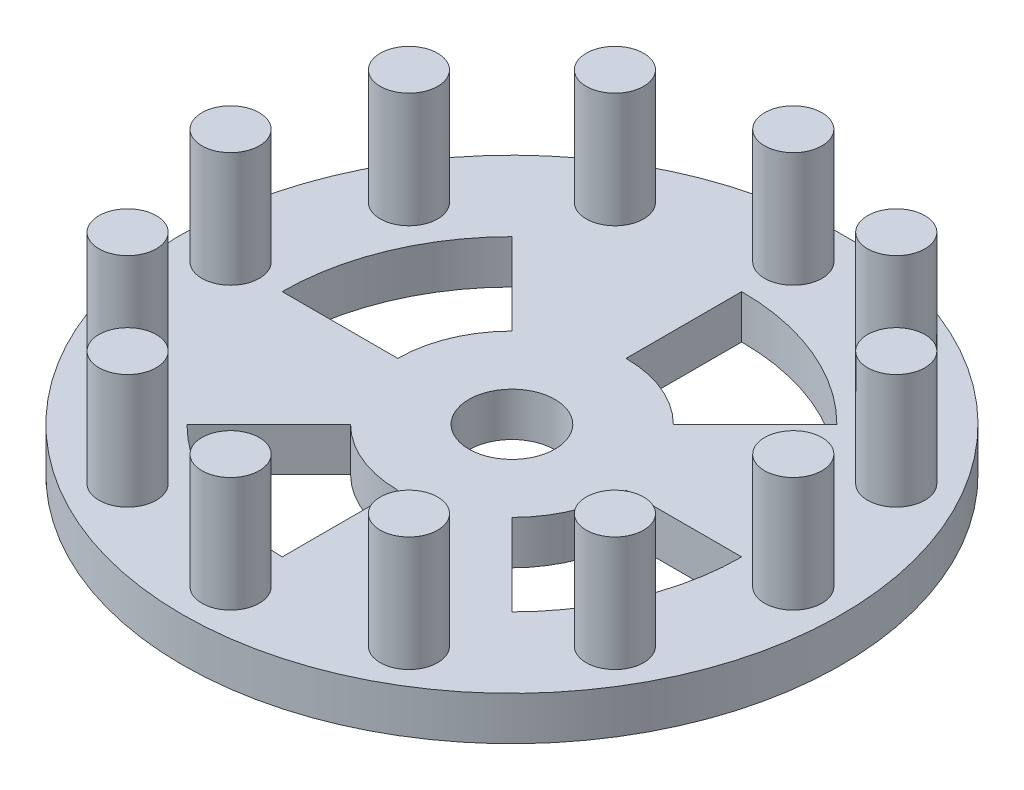
ISO-10303-21;
HEADER;
FILE_DESCRIPTION(('STEP AP214'),'2;1');
FILE_NAME('part.step','',(''),(''),'','','');
FILE_SCHEMA(('AUTOMOTIVE_DESIGN { 1 0 10303 214 1 1 1 1 }'));
ENDSEC;
DATA;
#1=APPLICATION_CONTEXT('core data for automotive mechanical design processes');
#2=APPLICATION_PROTOCOL_DEFINITION('international standard','automotive_design',2000,#1);
#3=PRODUCT_CONTEXT('',#1,'mechanical');
#4=PRODUCT('Part','Part','',(#3));
#5=PRODUCT_RELATED_PRODUCT_CATEGORY('part','',(#4));
#6=PRODUCT_DEFINITION_FORMATION('','',#4);
#7=PRODUCT_DEFINITION_CONTEXT('part definition',#1,'design');
#8=PRODUCT_DEFINITION('design','',#6,#7);
#9=PRODUCT_DEFINITION_SHAPE('','',#8);
#10=(LENGTH_UNIT() NAMED_UNIT(*) SI_UNIT(.MILLI.,.METRE.));
#11=(NAMED_UNIT(*) PLANE_ANGLE_UNIT() SI_UNIT($,.RADIAN.));
#12=(NAMED_UNIT(*) SI_UNIT($,.STERADIAN.) SOLID_ANGLE_UNIT());
#13=UNCERTAINTY_MEASURE_WITH_UNIT(LENGTH_MEASURE(1.E-05),#10,'distance_accuracy_value','');
#14=(GEOMETRIC_REPRESENTATION_CONTEXT(3) GLOBAL_UNCERTAINTY_ASSIGNED_CONTEXT((#13)) GLOBAL_UNIT_ASSIGNED_CONTEXT((#10,
#11,#12)) REPRESENTATION_CONTEXT('',''));
#15=CARTESIAN_POINT('',(0.,0.,0.));
#16=DIRECTION('',(0.,0.,1.));
#17=DIRECTION('',(1.,0.,0.));
#18=AXIS2_PLACEMENT_3D('',#15,#16,#17);
#19=CARTESIAN_POINT('',(31.8964117166924,4.826,-77.0049131346049));
#20=DIRECTION('',(0.,1.,0.));
#21=DIRECTION('',(0.,0.,1.));
#22=AXIS2_PLACEMENT_3D('',#19,#20,#21);
#23=PLANE('',#22);
#24=CARTESIAN_POINT('',(31.8964117166924,4.826,-77.0049131346049));
#25=DIRECTION('',(0.,1.,0.));
#26=DIRECTION('',(-1.,0.,0.));
#27=AXIS2_PLACEMENT_3D('',#24,#25,#26);
#28=CIRCLE('',#27,25.4118350403114);
#29=CARTESIAN_POINT('',(49.8652925960908,4.826,-59.036032255207));
#30=VERTEX_POINT('',#29);
#31=CARTESIAN_POINT('',(57.3082467570038,4.826,-77.0049131346052));
#32=VERTEX_POINT('',#31);
#33=EDGE_CURVE('E45',#30,#32,#28,.T.);
#34=ORIENTED_EDGE('',*,*,#33,.F.);
#35=DIRECTION('',(0.707106781186557,0.,0.707106781186538));
#36=VECTOR('',#35,1.);
#37=CARTESIAN_POINT('',(40.819765813324,4.826,-68.0815590379736));
#38=LINE('',#37,#36);
#39=CARTESIAN_POINT('',(40.819765813324,4.826,-68.0815590379736));
#40=VERTEX_POINT('',#39);
#41=EDGE_CURVE('E161',#40,#30,#38,.T.);
#42=ORIENTED_EDGE('',*,*,#41,.F.);
#43=CARTESIAN_POINT('',(31.8964117166924,4.826,-77.0049131346049));
#44=DIRECTION('',(0.,-1.,0.));
#45=DIRECTION('',(-1.,0.,0.));
#46=AXIS2_PLACEMENT_3D('',#43,#44,#45);
#47=CIRCLE('',#46,12.6195283853137);
#48=CARTESIAN_POINT('',(44.5159401020061,4.826,-77.004913134605));
#49=VERTEX_POINT('',#48);
#50=EDGE_CURVE('E146',#49,#40,#47,.T.);
#51=ORIENTED_EDGE('',*,*,#50,.F.);
#52=DIRECTION('',(-1.,0.,0.));
#53=VECTOR('',#52,1.);
#54=CARTESIAN_POINT('',(44.5159401020061,4.826,-77.004913134605));
#55=LINE('',#54,#53);
#56=EDGE_CURVE('E155',#32,#49,#55,.T.);
#57=ORIENTED_EDGE('',*,*,#56,.F.);
#58=EDGE_LOOP('',(#34,#42,#51,#57));
#59=FACE_BOUND('',#58,.T.);
#60=CARTESIAN_POINT('',(31.8964117166924,4.826,-77.0049131346049));
#61=DIRECTION('',(0.,1.,0.));
#62=DIRECTION('',(0.,0.,-1.));
#63=AXIS2_PLACEMENT_3D('',#60,#61,#62);
#64=CIRCLE('',#63,25.4118350403114);
#65=CARTESIAN_POINT('',(13.9275308372945,4.826,-59.0360322552066));
#66=VERTEX_POINT('',#65);
#67=CARTESIAN_POINT('',(31.8964117166926,4.826,-51.5930780942935));
#68=VERTEX_POINT('',#67);
#69=EDGE_CURVE('E168',#66,#68,#64,.T.);
#70=ORIENTED_EDGE('',*,*,#69,.F.);
#71=DIRECTION('',(-0.707106781186541,0.,0.707106781186554));
#72=VECTOR('',#71,1.);
#73=CARTESIAN_POINT('',(22.9730576200611,4.826,-68.0815590379734));
#74=LINE('',#73,#72);
#75=CARTESIAN_POINT('',(22.9730576200611,4.826,-68.0815590379734));
#76=VERTEX_POINT('',#75);
#77=EDGE_CURVE('E178',#76,#66,#74,.T.);
#78=ORIENTED_EDGE('',*,*,#77,.F.);
#79=CARTESIAN_POINT('',(31.8964117166924,4.826,-77.0049131346049));
#80=DIRECTION('',(0.,-1.,0.));
#81=DIRECTION('',(0.,0.,-1.));
#82=AXIS2_PLACEMENT_3D('',#79,#80,#81);
#83=CIRCLE('',#82,12.6195283853137);
#84=CARTESIAN_POINT('',(31.8964117166925,4.826,-64.3853847492912));
#85=VERTEX_POINT('',#84);
#86=EDGE_CURVE('E175',#85,#76,#83,.T.);
#87=ORIENTED_EDGE('',*,*,#86,.F.);
#88=DIRECTION('',(0.,0.,-1.));
#89=VECTOR('',#88,1.);
#90=CARTESIAN_POINT('',(31.8964117166925,4.826,-64.3853847492912));
#91=LINE('',#90,#89);
#92=EDGE_CURVE('E172',#68,#85,#91,.T.);
#93=ORIENTED_EDGE('',*,*,#92,.F.);
#94=EDGE_LOOP('',(#70,#78,#87,#93));
#95=FACE_BOUND('',#94,.T.);
#96=CARTESIAN_POINT('',(31.8964117166924,4.826,-77.0049131346049));
#97=DIRECTION('',(0.,1.,0.));
#98=DIRECTION('',(1.,0.,0.));
#99=AXIS2_PLACEMENT_3D('',#96,#97,#98);
#100=CIRCLE('',#99,25.4118350403114);
#101=CARTESIAN_POINT('',(13.9275308372942,4.826,-94.9737940140029));
#102=VERTEX_POINT('',#101);
#103=CARTESIAN_POINT('',(6.48457667638105,4.826,-77.0049131346048));
#104=VERTEX_POINT('',#103);
#105=EDGE_CURVE('E184',#102,#104,#100,.T.);
#106=ORIENTED_EDGE('',*,*,#105,.F.);
#107=DIRECTION('',(-0.707106781186552,0.,-0.707106781186543));
#108=VECTOR('',#107,1.);
#109=CARTESIAN_POINT('',(22.973057620061,4.826,-85.9282672312363));
#110=LINE('',#109,#108);
#111=CARTESIAN_POINT('',(22.973057620061,4.826,-85.9282672312363));
#112=VERTEX_POINT('',#111);
#113=EDGE_CURVE('E198',#112,#102,#110,.T.);
#114=ORIENTED_EDGE('',*,*,#113,.F.);
#115=CARTESIAN_POINT('',(31.8964117166924,4.826,-77.0049131346049));
#116=DIRECTION('',(0.,-1.,0.));
#117=DIRECTION('',(1.,0.,0.));
#118=AXIS2_PLACEMENT_3D('',#115,#116,#117);
#119=CIRCLE('',#118,12.6195283853137);
#120=CARTESIAN_POINT('',(19.2768833313788,4.826,-77.0049131346048));
#121=VERTEX_POINT('',#120);
#122=EDGE_CURVE('E195',#121,#112,#119,.T.);
#123=ORIENTED_EDGE('',*,*,#122,.F.);
#124=DIRECTION('',(1.,0.,0.));
#125=VECTOR('',#124,1.);
#126=CARTESIAN_POINT('',(19.2768833313788,4.826,-77.0049131346048));
#127=LINE('',#126,#125);
#128=EDGE_CURVE('E192',#104,#121,#127,.T.);
#129=ORIENTED_EDGE('',*,*,#128,.F.);
#130=EDGE_LOOP('',(#106,#114,#123,#129));
#131=FACE_BOUND('',#130,.T.);
#132=CARTESIAN_POINT('',(31.8964117166924,4.826,-77.0049131346049));
#133=DIRECTION('',(0.,1.,0.));
#134=DIRECTION('',(0.,0.,1.));
#135=AXIS2_PLACEMENT_3D('',#132,#133,#134);
#136=CIRCLE('',#135,25.4118350403114);
#137=CARTESIAN_POINT('',(49.8652925960905,4.826,-94.973794014003));
#138=VERTEX_POINT('',#137);
#139=CARTESIAN_POINT('',(31.8964117166924,4.826,-102.416748174916));
#140=VERTEX_POINT('',#139);
#141=EDGE_CURVE('E204',#138,#140,#136,.T.);
#142=ORIENTED_EDGE('',*,*,#141,.F.);
#143=DIRECTION('',(0.707106781186546,0.,-0.707106781186549));
#144=VECTOR('',#143,1.);
#145=CARTESIAN_POINT('',(40.8197658133238,4.826,-85.9282672312363));
#146=LINE('',#145,#144);
#147=CARTESIAN_POINT('',(40.8197658133238,4.826,-85.9282672312363));
#148=VERTEX_POINT('',#147);
#149=EDGE_CURVE('E218',#148,#138,#146,.T.);
#150=ORIENTED_EDGE('',*,*,#149,.F.);
#151=CARTESIAN_POINT('',(31.8964117166924,4.826,-77.0049131346049));
#152=DIRECTION('',(0.,-1.,0.));
#153=DIRECTION('',(0.,0.,1.));
#154=AXIS2_PLACEMENT_3D('',#151,#152,#153);
#155=CIRCLE('',#154,12.6195283853137);
#156=CARTESIAN_POINT('',(31.8964117166924,4.826,-89.6244415199186));
#157=VERTEX_POINT('',#156);
#158=EDGE_CURVE('E215',#157,#148,#155,.T.);
#159=ORIENTED_EDGE('',*,*,#158,.F.);
#160=DIRECTION('',(0.,0.,1.));
#161=VECTOR('',#160,1.);
#162=CARTESIAN_POINT('',(31.8964117166924,4.826,-89.6244415199186));
#163=LINE('',#162,#161);
#164=EDGE_CURVE('E212',#140,#157,#163,.T.);
#165=ORIENTED_EDGE('',*,*,#164,.F.);
#166=EDGE_LOOP('',(#142,#150,#159,#165));
#167=FACE_BOUND('',#166,.T.);
#168=CARTESIAN_POINT('',(47.4539117166928,4.826,-50.0585326958523));
#169=DIRECTION('',(0.,1.,0.));
#170=DIRECTION('',(-0.866025403784433,0.,0.50000000000001));
#171=AXIS2_PLACEMENT_3D('',#168,#169,#170);
#172=CIRCLE('',#171,3.175);
#173=CARTESIAN_POINT('',(44.7042810596772,4.826,-48.4710326958522));
#174=VERTEX_POINT('',#173);
#175=EDGE_CURVE('E234',#174,#174,#172,.T.);
#176=ORIENTED_EDGE('',*,*,#175,.F.);
#177=EDGE_LOOP('',(#176));
#178=FACE_BOUND('',#177,.T.);
#179=CARTESIAN_POINT('',(16.3389117166927,4.826,-50.0585326958519));
#180=DIRECTION('',(0.,1.,0.));
#181=DIRECTION('',(-0.866025403784443,0.,-0.499999999999992));
#182=AXIS2_PLACEMENT_3D('',#179,#180,#181);
#183=CIRCLE('',#182,3.175);
#184=CARTESIAN_POINT('',(13.5892810596771,4.826,-51.6460326958519));
#185=VERTEX_POINT('',#184);
#186=EDGE_CURVE('E246',#185,#185,#183,.T.);
#187=ORIENTED_EDGE('',*,*,#186,.F.);
#188=EDGE_LOOP('',(#187));
#189=FACE_BOUND('',#188,.T.);
#190=CARTESIAN_POINT('',(0.781411716692451,4.826,-77.0049131346047));
#191=DIRECTION('',(0.,1.,0.));
#192=DIRECTION('',(0.,0.,-1.));
#193=AXIS2_PLACEMENT_3D('',#190,#191,#192);
#194=CIRCLE('',#193,3.175);
#195=CARTESIAN_POINT('',(0.781411716692429,4.826,-80.1799131346047));
#196=VERTEX_POINT('',#195);
#197=EDGE_CURVE('E258',#196,#196,#194,.T.);
#198=ORIENTED_EDGE('',*,*,#197,.F.);
#199=EDGE_LOOP('',(#198));
#200=FACE_BOUND('',#199,.T.);
#201=CARTESIAN_POINT('',(16.3389117166923,4.826,-103.951293573358));
#202=DIRECTION('',(0.,1.,0.));
#203=DIRECTION('',(0.866025403784436,0.,-0.500000000000004));
#204=AXIS2_PLACEMENT_3D('',#201,#202,#203);
#205=CIRCLE('',#204,3.175);
#206=CARTESIAN_POINT('',(19.0885423737079,4.826,-105.538793573358));
#207=VERTEX_POINT('',#206);
#208=EDGE_CURVE('E270',#207,#207,#205,.T.);
#209=ORIENTED_EDGE('',*,*,#208,.F.);
#210=EDGE_LOOP('',(#209));
#211=FACE_BOUND('',#210,.T.);
#212=CARTESIAN_POINT('',(47.4539117166924,4.826,-103.951293573358));
#213=DIRECTION('',(0.,1.,0.));
#214=DIRECTION('',(0.86602540378444,0.,0.499999999999998));
#215=AXIS2_PLACEMENT_3D('',#212,#213,#214);
#216=CIRCLE('',#215,3.175);
#217=CARTESIAN_POINT('',(50.203542373708,4.826,-102.363793573358));
#218=VERTEX_POINT('',#217);
#219=EDGE_CURVE('E282',#218,#218,#216,.T.);
#220=ORIENTED_EDGE('',*,*,#219,.F.);
#221=EDGE_LOOP('',(#220));
#222=FACE_BOUND('',#221,.T.);
#223=CARTESIAN_POINT('',(63.0114117166924,4.826,-77.0049131346049));
#224=DIRECTION('',(0.,1.,0.));
#225=DIRECTION('',(0.,0.,1.));
#226=AXIS2_PLACEMENT_3D('',#223,#224,#225);
#227=CIRCLE('',#226,3.175);
#228=CARTESIAN_POINT('',(63.0114117166924,4.826,-73.8299131346049));
#229=VERTEX_POINT('',#228);
#230=EDGE_CURVE('E294',#229,#229,#227,.T.);
#231=ORIENTED_EDGE('',*,*,#230,.F.);
#232=EDGE_LOOP('',(#231));
#233=FACE_BOUND('',#232,.T.);
#234=CARTESIAN_POINT('',(31.8964117166924,4.826,-77.0049131346049));
#235=DIRECTION('',(0.,1.,0.));
#236=DIRECTION('',(0.,0.,1.));
#237=AXIS2_PLACEMENT_3D('',#234,#235,#236);
#238=CIRCLE('',#237,36.449);
#239=CARTESIAN_POINT('',(31.8964117166924,4.826,-40.5559131346049));
#240=VERTEX_POINT('',#239);
#241=EDGE_CURVE('E309',#240,#240,#238,.T.);
#242=ORIENTED_EDGE('',*,*,#241,.T.);
#243=EDGE_LOOP('',(#242));
#244=FACE_BOUND('',#243,.T.);
#245=CARTESIAN_POINT('',(31.8964117166924,4.826,-77.0049131346049));
#246=DIRECTION('',(0.,1.,0.));
#247=DIRECTION('',(0.,0.,1.));
#248=AXIS2_PLACEMENT_3D('',#245,#246,#247);
#249=CIRCLE('',#248,4.7625);
#250=CARTESIAN_POINT('',(31.8964117166924,4.826,-72.2424131346049));
#251=VERTEX_POINT('',#250);
#252=EDGE_CURVE('E303',#251,#251,#249,.T.);
#253=ORIENTED_EDGE('',*,*,#252,.F.);
#254=EDGE_LOOP('',(#253));
#255=FACE_BOUND('',#254,.T.);
#256=CARTESIAN_POINT('',(58.8427921554452,4.826,-92.5624131346049));
#257=DIRECTION('',(0.,1.,0.));
#258=DIRECTION('',(0.500000000000001,0.,0.866025403784438));
#259=AXIS2_PLACEMENT_3D('',#256,#257,#258);
#260=CIRCLE('',#259,3.175);
#261=CARTESIAN_POINT('',(60.4302921554452,4.826,-89.8127824775894));
#262=VERTEX_POINT('',#261);
#263=EDGE_CURVE('E288',#262,#262,#260,.T.);
#264=ORIENTED_EDGE('',*,*,#263,.F.);
#265=EDGE_LOOP('',(#264));
#266=FACE_BOUND('',#265,.T.);
#267=CARTESIAN_POINT('',(31.8964117166923,4.826,-108.119913134605));
#268=DIRECTION('',(0.,1.,0.));
#269=DIRECTION('',(1.,0.,0.));
#270=AXIS2_PLACEMENT_3D('',#267,#268,#269);
#271=CIRCLE('',#270,3.175);
#272=CARTESIAN_POINT('',(35.0714117166923,4.826,-108.119913134605));
#273=VERTEX_POINT('',#272);
#274=EDGE_CURVE('E276',#273,#273,#271,.T.);
#275=ORIENTED_EDGE('',*,*,#274,.F.);
#276=EDGE_LOOP('',(#275));
#277=FACE_BOUND('',#276,.T.);
#278=CARTESIAN_POINT('',(4.95003127793954,4.826,-92.5624131346047));
#279=DIRECTION('',(0.,1.,0.));
#280=DIRECTION('',(0.499999999999995,0.,-0.866025403784442));
#281=AXIS2_PLACEMENT_3D('',#278,#279,#280);
#282=CIRCLE('',#281,3.175);
#283=CARTESIAN_POINT('',(6.53753127793952,4.826,-95.3120437916203));
#284=VERTEX_POINT('',#283);
#285=EDGE_CURVE('E264',#284,#284,#282,.T.);
#286=ORIENTED_EDGE('',*,*,#285,.F.);
#287=EDGE_LOOP('',(#286));
#288=FACE_BOUND('',#287,.T.);
#289=CARTESIAN_POINT('',(4.95003127793975,4.826,-61.4474131346047));
#290=DIRECTION('',(0.,1.,0.));
#291=DIRECTION('',(-0.500000000000007,0.,-0.866025403784435));
#292=AXIS2_PLACEMENT_3D('',#289,#290,#291);
#293=CIRCLE('',#292,3.175);
#294=CARTESIAN_POINT('',(3.36253127793973,4.826,-64.1970437916202));
#295=VERTEX_POINT('',#294);
#296=EDGE_CURVE('E252',#295,#295,#293,.T.);
#297=ORIENTED_EDGE('',*,*,#296,.F.);
#298=EDGE_LOOP('',(#297));
#299=FACE_BOUND('',#298,.T.);
#300=CARTESIAN_POINT('',(31.8964117166928,4.826,-45.8899131346049));
#301=DIRECTION('',(0.,1.,0.));
#302=DIRECTION('',(-1.,0.,0.));
#303=AXIS2_PLACEMENT_3D('',#300,#301,#302);
#304=CIRCLE('',#303,3.175);
#305=CARTESIAN_POINT('',(28.7214117166928,4.826,-45.8899131346049));
#306=VERTEX_POINT('',#305);
#307=EDGE_CURVE('E240',#306,#306,#304,.T.);
#308=ORIENTED_EDGE('',*,*,#307,.F.);
#309=EDGE_LOOP('',(#308));
#310=FACE_BOUND('',#309,.T.);
#311=CARTESIAN_POINT('',(58.8427921554454,4.826,-61.4474131346052));
#312=DIRECTION('',(0.,1.,0.));
#313=DIRECTION('',(-0.499999999999989,0.,0.866025403784445));
#314=AXIS2_PLACEMENT_3D('',#311,#312,#313);
#315=CIRCLE('',#314,3.175);
#316=CARTESIAN_POINT('',(57.2552921554455,4.826,-58.6977824775896));
#317=VERTEX_POINT('',#316);
#318=EDGE_CURVE('E224',#317,#317,#315,.T.);
#319=ORIENTED_EDGE('',*,*,#318,.F.);
#320=EDGE_LOOP('',(#319));
#321=FACE_BOUND('',#320,.T.);
#322=ADVANCED_FACE('F30',(#59,#95,#131,#167,#178,#189,#200,#211,#222,#233,#244,#255,#266,#277,
#288,#299,#310,#321),#23,.T.);
#323=CARTESIAN_POINT('',(31.8964117166924,0.,-77.0049131346049));
#324=DIRECTION('',(0.,1.,0.));
#325=DIRECTION('',(0.,0.,1.));
#326=AXIS2_PLACEMENT_3D('',#323,#324,#325);
#327=PLANE('',#326);
#328=DIRECTION('',(0.707106781186557,0.,0.707106781186538));
#329=VECTOR('',#328,1.);
#330=CARTESIAN_POINT('',(31.8964117166924,0.,-77.0049131346049));
#331=LINE('',#330,#329);
#332=CARTESIAN_POINT('',(40.819765813324,0.,-68.0815590379736));
#333=VERTEX_POINT('',#332);
#334=CARTESIAN_POINT('',(49.8652925960908,0.,-59.036032255207));
#335=VERTEX_POINT('',#334);
#336=EDGE_CURVE('E38',#333,#335,#331,.T.);
#337=ORIENTED_EDGE('',*,*,#336,.T.);
#338=CARTESIAN_POINT('',(31.8964117166924,0.,-77.0049131346049));
#339=DIRECTION('',(0.,1.,0.));
#340=DIRECTION('',(0.,0.,1.));
#341=AXIS2_PLACEMENT_3D('',#338,#339,#340);
#342=CIRCLE('',#341,25.4118350403114);
#343=CARTESIAN_POINT('',(57.3082467570038,0.,-77.0049131346052));
#344=VERTEX_POINT('',#343);
#345=EDGE_CURVE('E11',#335,#344,#342,.T.);
#346=ORIENTED_EDGE('',*,*,#345,.T.);
#347=DIRECTION('',(-1.,0.,0.));
#348=VECTOR('',#347,1.);
#349=CARTESIAN_POINT('',(31.8964117166924,0.,-77.0049131346049));
#350=LINE('',#349,#348);
#351=CARTESIAN_POINT('',(44.5159401020061,0.,-77.004913134605));
#352=VERTEX_POINT('',#351);
#353=EDGE_CURVE('E350',#344,#352,#350,.T.);
#354=ORIENTED_EDGE('',*,*,#353,.T.);
#355=CARTESIAN_POINT('',(31.8964117166924,0.,-77.0049131346049));
#356=DIRECTION('',(0.,1.,0.));
#357=DIRECTION('',(0.,0.,1.));
#358=AXIS2_PLACEMENT_3D('',#355,#356,#357);
#359=CIRCLE('',#358,12.6195283853137);
#360=EDGE_CURVE('E149',#352,#333,#359,.F.);
#361=ORIENTED_EDGE('',*,*,#360,.T.);
#362=EDGE_LOOP('',(#337,#346,#354,#361));
#363=FACE_BOUND('',#362,.T.);
#364=DIRECTION('',(-0.707106781186541,0.,0.707106781186554));
#365=VECTOR('',#364,1.);
#366=CARTESIAN_POINT('',(31.8964117166924,0.,-77.0049131346049));
#367=LINE('',#366,#365);
#368=CARTESIAN_POINT('',(22.9730576200611,0.,-68.0815590379734));
#369=VERTEX_POINT('',#368);
#370=CARTESIAN_POINT('',(13.9275308372945,0.,-59.0360322552066));
#371=VERTEX_POINT('',#370);
#372=EDGE_CURVE('E344',#369,#371,#367,.T.);
#373=ORIENTED_EDGE('',*,*,#372,.T.);
#374=CARTESIAN_POINT('',(31.8964117166924,0.,-77.0049131346049));
#375=DIRECTION('',(0.,1.,0.));
#376=DIRECTION('',(0.,0.,1.));
#377=AXIS2_PLACEMENT_3D('',#374,#375,#376);
#378=CIRCLE('',#377,25.4118350403114);
#379=CARTESIAN_POINT('',(31.8964117166926,0.,-51.5930780942935));
#380=VERTEX_POINT('',#379);
#381=EDGE_CURVE('E347',#371,#380,#378,.T.);
#382=ORIENTED_EDGE('',*,*,#381,.T.);
#383=DIRECTION('',(0.,0.,-1.));
#384=VECTOR('',#383,1.);
#385=CARTESIAN_POINT('',(31.8964117166924,0.,-77.0049131346049));
#386=LINE('',#385,#384);
#387=CARTESIAN_POINT('',(31.8964117166925,0.,-64.3853847492912));
#388=VERTEX_POINT('',#387);
#389=EDGE_CURVE('E338',#380,#388,#386,.T.);
#390=ORIENTED_EDGE('',*,*,#389,.T.);
#391=CARTESIAN_POINT('',(31.8964117166924,0.,-77.0049131346049));
#392=DIRECTION('',(0.,1.,0.));
#393=DIRECTION('',(0.,0.,1.));
#394=AXIS2_PLACEMENT_3D('',#391,#392,#393);
#395=CIRCLE('',#394,12.6195283853137);
#396=EDGE_CURVE('E341',#388,#369,#395,.F.);
#397=ORIENTED_EDGE('',*,*,#396,.T.);
#398=EDGE_LOOP('',(#373,#382,#390,#397));
#399=FACE_BOUND('',#398,.T.);
#400=DIRECTION('',(-0.707106781186552,0.,-0.707106781186543));
#401=VECTOR('',#400,1.);
#402=CARTESIAN_POINT('',(31.8964117166925,0.,-77.0049131346049));
#403=LINE('',#402,#401);
#404=CARTESIAN_POINT('',(22.973057620061,0.,-85.9282672312363));
#405=VERTEX_POINT('',#404);
#406=CARTESIAN_POINT('',(13.9275308372942,0.,-94.9737940140029));
#407=VERTEX_POINT('',#406);
#408=EDGE_CURVE('E332',#405,#407,#403,.T.);
#409=ORIENTED_EDGE('',*,*,#408,.T.);
#410=CARTESIAN_POINT('',(31.8964117166924,0.,-77.0049131346049));
#411=DIRECTION('',(0.,1.,0.));
#412=DIRECTION('',(0.,0.,1.));
#413=AXIS2_PLACEMENT_3D('',#410,#411,#412);
#414=CIRCLE('',#413,25.4118350403114);
#415=CARTESIAN_POINT('',(6.48457667638105,0.,-77.0049131346048));
#416=VERTEX_POINT('',#415);
#417=EDGE_CURVE('E335',#407,#416,#414,.T.);
#418=ORIENTED_EDGE('',*,*,#417,.T.);
#419=DIRECTION('',(1.,0.,0.));
#420=VECTOR('',#419,1.);
#421=CARTESIAN_POINT('',(31.8964117166924,0.,-77.0049131346049));
#422=LINE('',#421,#420);
#423=CARTESIAN_POINT('',(19.2768833313788,0.,-77.0049131346048));
#424=VERTEX_POINT('',#423);
#425=EDGE_CURVE('E326',#416,#424,#422,.T.);
#426=ORIENTED_EDGE('',*,*,#425,.T.);
#427=CARTESIAN_POINT('',(31.8964117166924,0.,-77.0049131346049));
#428=DIRECTION('',(0.,1.,0.));
#429=DIRECTION('',(0.,0.,1.));
#430=AXIS2_PLACEMENT_3D('',#427,#428,#429);
#431=CIRCLE('',#430,12.6195283853137);
#432=EDGE_CURVE('E329',#424,#405,#431,.F.);
#433=ORIENTED_EDGE('',*,*,#432,.T.);
#434=EDGE_LOOP('',(#409,#418,#426,#433));
#435=FACE_BOUND('',#434,.T.);
#436=DIRECTION('',(0.707106781186546,0.,-0.707106781186549));
#437=VECTOR('',#436,1.);
#438=CARTESIAN_POINT('',(31.8964117166924,0.,-77.0049131346049));
#439=LINE('',#438,#437);
#440=CARTESIAN_POINT('',(40.8197658133238,0.,-85.9282672312363));
#441=VERTEX_POINT('',#440);
#442=CARTESIAN_POINT('',(49.8652925960905,0.,-94.973794014003));
#443=VERTEX_POINT('',#442);
#444=EDGE_CURVE('E320',#441,#443,#439,.T.);
#445=ORIENTED_EDGE('',*,*,#444,.T.);
#446=CARTESIAN_POINT('',(31.8964117166924,0.,-77.0049131346049));
#447=DIRECTION('',(0.,1.,0.));
#448=DIRECTION('',(0.,0.,1.));
#449=AXIS2_PLACEMENT_3D('',#446,#447,#448);
#450=CIRCLE('',#449,25.4118350403114);
#451=CARTESIAN_POINT('',(31.8964117166924,0.,-102.416748174916));
#452=VERTEX_POINT('',#451);
#453=EDGE_CURVE('E323',#443,#452,#450,.T.);
#454=ORIENTED_EDGE('',*,*,#453,.T.);
#455=DIRECTION('',(0.,0.,1.));
#456=VECTOR('',#455,1.);
#457=CARTESIAN_POINT('',(31.8964117166924,0.,-77.0049131346049));
#458=LINE('',#457,#456);
#459=CARTESIAN_POINT('',(31.8964117166924,0.,-89.6244415199186));
#460=VERTEX_POINT('',#459);
#461=EDGE_CURVE('E312',#452,#460,#458,.T.);
#462=ORIENTED_EDGE('',*,*,#461,.T.);
#463=CARTESIAN_POINT('',(31.8964117166924,0.,-77.0049131346049));
#464=DIRECTION('',(0.,1.,0.));
#465=DIRECTION('',(0.,0.,1.));
#466=AXIS2_PLACEMENT_3D('',#463,#464,#465);
#467=CIRCLE('',#466,12.6195283853137);
#468=EDGE_CURVE('E317',#460,#441,#467,.F.);
#469=ORIENTED_EDGE('',*,*,#468,.T.);
#470=EDGE_LOOP('',(#445,#454,#462,#469));
#471=FACE_BOUND('',#470,.T.);
#472=CARTESIAN_POINT('',(31.8964117166924,0.,-77.0049131346049));
#473=DIRECTION('',(0.,1.,0.));
#474=DIRECTION('',(0.,0.,1.));
#475=AXIS2_PLACEMENT_3D('',#472,#473,#474);
#476=CIRCLE('',#475,36.449);
#477=CARTESIAN_POINT('',(31.8964117166924,0.,-40.5559131346049));
#478=VERTEX_POINT('',#477);
#479=EDGE_CURVE('E306',#478,#478,#476,.T.);
#480=ORIENTED_EDGE('',*,*,#479,.F.);
#481=EDGE_LOOP('',(#480));
#482=FACE_BOUND('',#481,.T.);
#483=CARTESIAN_POINT('',(31.8964117166924,0.,-77.0049131346049));
#484=DIRECTION('',(0.,1.,0.));
#485=DIRECTION('',(0.,0.,1.));
#486=AXIS2_PLACEMENT_3D('',#483,#484,#485);
#487=CIRCLE('',#486,4.7625);
#488=CARTESIAN_POINT('',(31.8964117166924,0.,-72.2424131346049));
#489=VERTEX_POINT('',#488);
#490=EDGE_CURVE('E300',#489,#489,#487,.T.);
#491=ORIENTED_EDGE('',*,*,#490,.T.);
#492=EDGE_LOOP('',(#491));
#493=FACE_BOUND('',#492,.T.);
#494=ADVANCED_FACE('F354',(#363,#399,#435,#471,#482,#493),#327,.F.);
#495=CARTESIAN_POINT('',(31.8964117166924,4.826,-77.0049131346049));
#496=DIRECTION('',(0.,-1.,0.));
#497=DIRECTION('',(0.,0.,-1.));
#498=AXIS2_PLACEMENT_3D('',#495,#496,#497);
#499=CYLINDRICAL_SURFACE('',#498,36.449);
#500=ORIENTED_EDGE('',*,*,#241,.F.);
#501=EDGE_LOOP('',(#500));
#502=FACE_BOUND('',#501,.T.);
#503=ORIENTED_EDGE('',*,*,#479,.T.);
#504=EDGE_LOOP('',(#503));
#505=FACE_BOUND('',#504,.T.);
#506=ADVANCED_FACE('F32',(#502,#505),#499,.T.);
#507=CARTESIAN_POINT('',(31.8964117166924,4.826,-77.0049131346049));
#508=DIRECTION('',(0.,-1.,0.));
#509=DIRECTION('',(0.,0.,-1.));
#510=AXIS2_PLACEMENT_3D('',#507,#508,#509);
#511=CYLINDRICAL_SURFACE('',#510,4.7625);
#512=ORIENTED_EDGE('',*,*,#252,.T.);
#513=EDGE_LOOP('',(#512));
#514=FACE_BOUND('',#513,.T.);
#515=ORIENTED_EDGE('',*,*,#490,.F.);
#516=EDGE_LOOP('',(#515));
#517=FACE_BOUND('',#516,.T.);
#518=ADVANCED_FACE('F379',(#514,#517),#511,.F.);
#519=CARTESIAN_POINT('',(63.0114117166924,17.526,-77.0049131346049));
#520=DIRECTION('',(0.,-1.,0.));
#521=DIRECTION('',(0.,0.,-1.));
#522=AXIS2_PLACEMENT_3D('',#519,#520,#521);
#523=CYLINDRICAL_SURFACE('',#522,3.175);
#524=CARTESIAN_POINT('',(63.0114117166924,17.526,-77.0049131346049));
#525=DIRECTION('',(0.,1.,0.));
#526=DIRECTION('',(0.,0.,1.));
#527=AXIS2_PLACEMENT_3D('',#524,#525,#526);
#528=CIRCLE('',#527,3.175);
#529=CARTESIAN_POINT('',(63.0114117166924,17.526,-73.8299131346049));
#530=VERTEX_POINT('',#529);
#531=EDGE_CURVE('E297',#530,#530,#528,.T.);
#532=ORIENTED_EDGE('',*,*,#531,.F.);
#533=EDGE_LOOP('',(#532));
#534=FACE_BOUND('',#533,.T.);
#535=ORIENTED_EDGE('',*,*,#230,.T.);
#536=EDGE_LOOP('',(#535));
#537=FACE_BOUND('',#536,.T.);
#538=ADVANCED_FACE('F382',(#534,#537),#523,.T.);
#539=CARTESIAN_POINT('',(63.0114117166924,17.526,-77.0049131346049));
#540=DIRECTION('',(0.,1.,0.));
#541=DIRECTION('',(0.,0.,1.));
#542=AXIS2_PLACEMENT_3D('',#539,#540,#541);
#543=PLANE('',#542);
#544=ORIENTED_EDGE('',*,*,#531,.T.);
#545=EDGE_LOOP('',(#544));
#546=FACE_BOUND('',#545,.T.);
#547=ADVANCED_FACE('F386',(#546),#543,.T.);
#548=CARTESIAN_POINT('',(58.8427921554452,17.526,-92.5624131346049));
#549=DIRECTION('',(0.,-1.,0.));
#550=DIRECTION('',(0.,0.,-1.));
#551=AXIS2_PLACEMENT_3D('',#548,#549,#550);
#552=CYLINDRICAL_SURFACE('',#551,3.175);
#553=CARTESIAN_POINT('',(58.8427921554452,17.526,-92.5624131346049));
#554=DIRECTION('',(0.,1.,0.));
#555=DIRECTION('',(0.500000000000001,0.,0.866025403784438));
#556=AXIS2_PLACEMENT_3D('',#553,#554,#555);
#557=CIRCLE('',#556,3.175);
#558=CARTESIAN_POINT('',(60.4302921554452,17.526,-89.8127824775894));
#559=VERTEX_POINT('',#558);
#560=EDGE_CURVE('E291',#559,#559,#557,.T.);
#561=ORIENTED_EDGE('',*,*,#560,.F.);
#562=EDGE_LOOP('',(#561));
#563=FACE_BOUND('',#562,.T.);
#564=ORIENTED_EDGE('',*,*,#263,.T.);
#565=EDGE_LOOP('',(#564));
#566=FACE_BOUND('',#565,.T.);
#567=ADVANCED_FACE('F390',(#563,#566),#552,.T.);
#568=CARTESIAN_POINT('',(58.8427921554452,17.526,-92.5624131346049));
#569=DIRECTION('',(0.,1.,0.));
#570=DIRECTION('',(0.500000000000001,0.,0.866025403784438));
#571=AXIS2_PLACEMENT_3D('',#568,#569,#570);
#572=PLANE('',#571);
#573=ORIENTED_EDGE('',*,*,#560,.T.);
#574=EDGE_LOOP('',(#573));
#575=FACE_BOUND('',#574,.T.);
#576=ADVANCED_FACE('F394',(#575),#572,.T.);
#577=CARTESIAN_POINT('',(47.4539117166924,17.526,-103.951293573358));
#578=DIRECTION('',(0.,-1.,0.));
#579=DIRECTION('',(0.,0.,-1.));
#580=AXIS2_PLACEMENT_3D('',#577,#578,#579);
#581=CYLINDRICAL_SURFACE('',#580,3.175);
#582=CARTESIAN_POINT('',(47.4539117166924,17.526,-103.951293573358));
#583=DIRECTION('',(0.,1.,0.));
#584=DIRECTION('',(0.86602540378444,0.,0.499999999999998));
#585=AXIS2_PLACEMENT_3D('',#582,#583,#584);
#586=CIRCLE('',#585,3.175);
#587=CARTESIAN_POINT('',(50.203542373708,17.526,-102.363793573358));
#588=VERTEX_POINT('',#587);
#589=EDGE_CURVE('E285',#588,#588,#586,.T.);
#590=ORIENTED_EDGE('',*,*,#589,.F.);
#591=EDGE_LOOP('',(#590));
#592=FACE_BOUND('',#591,.T.);
#593=ORIENTED_EDGE('',*,*,#219,.T.);
#594=EDGE_LOOP('',(#593));
#595=FACE_BOUND('',#594,.T.);
#596=ADVANCED_FACE('F398',(#592,#595),#581,.T.);
#597=CARTESIAN_POINT('',(47.4539117166924,17.526,-103.951293573358));
#598=DIRECTION('',(0.,1.,0.));
#599=DIRECTION('',(0.86602540378444,0.,0.499999999999998));
#600=AXIS2_PLACEMENT_3D('',#597,#598,#599);
#601=PLANE('',#600);
#602=ORIENTED_EDGE('',*,*,#589,.T.);
#603=EDGE_LOOP('',(#602));
#604=FACE_BOUND('',#603,.T.);
#605=ADVANCED_FACE('F402',(#604),#601,.T.);
#606=CARTESIAN_POINT('',(31.8964117166923,17.526,-108.119913134605));
#607=DIRECTION('',(0.,-1.,0.));
#608=DIRECTION('',(0.,0.,-1.));
#609=AXIS2_PLACEMENT_3D('',#606,#607,#608);
#610=CYLINDRICAL_SURFACE('',#609,3.175);
#611=CARTESIAN_POINT('',(31.8964117166923,17.526,-108.119913134605));
#612=DIRECTION('',(0.,1.,0.));
#613=DIRECTION('',(1.,0.,0.));
#614=AXIS2_PLACEMENT_3D('',#611,#612,#613);
#615=CIRCLE('',#614,3.175);
#616=CARTESIAN_POINT('',(35.0714117166923,17.526,-108.119913134605));
#617=VERTEX_POINT('',#616);
#618=EDGE_CURVE('E279',#617,#617,#615,.T.);
#619=ORIENTED_EDGE('',*,*,#618,.F.);
#620=EDGE_LOOP('',(#619));
#621=FACE_BOUND('',#620,.T.);
#622=ORIENTED_EDGE('',*,*,#274,.T.);
#623=EDGE_LOOP('',(#622));
#624=FACE_BOUND('',#623,.T.);
#625=ADVANCED_FACE('F406',(#621,#624),#610,.T.);
#626=CARTESIAN_POINT('',(31.8964117166923,17.526,-108.119913134605));
#627=DIRECTION('',(0.,1.,0.));
#628=DIRECTION('',(1.,0.,0.));
#629=AXIS2_PLACEMENT_3D('',#626,#627,#628);
#630=PLANE('',#629);
#631=ORIENTED_EDGE('',*,*,#618,.T.);
#632=EDGE_LOOP('',(#631));
#633=FACE_BOUND('',#632,.T.);
#634=ADVANCED_FACE('F410',(#633),#630,.T.);
#635=CARTESIAN_POINT('',(16.3389117166923,17.526,-103.951293573358));
#636=DIRECTION('',(0.,-1.,0.));
#637=DIRECTION('',(0.,0.,-1.));
#638=AXIS2_PLACEMENT_3D('',#635,#636,#637);
#639=CYLINDRICAL_SURFACE('',#638,3.175);
#640=CARTESIAN_POINT('',(16.3389117166923,17.526,-103.951293573358));
#641=DIRECTION('',(0.,1.,0.));
#642=DIRECTION('',(0.866025403784436,0.,-0.500000000000004));
#643=AXIS2_PLACEMENT_3D('',#640,#641,#642);
#644=CIRCLE('',#643,3.175);
#645=CARTESIAN_POINT('',(19.0885423737079,17.526,-105.538793573358));
#646=VERTEX_POINT('',#645);
#647=EDGE_CURVE('E273',#646,#646,#644,.T.);
#648=ORIENTED_EDGE('',*,*,#647,.F.);
#649=EDGE_LOOP('',(#648));
#650=FACE_BOUND('',#649,.T.);
#651=ORIENTED_EDGE('',*,*,#208,.T.);
#652=EDGE_LOOP('',(#651));
#653=FACE_BOUND('',#652,.T.);
#654=ADVANCED_FACE('F414',(#650,#653),#639,.T.);
#655=CARTESIAN_POINT('',(16.3389117166923,17.526,-103.951293573358));
#656=DIRECTION('',(0.,1.,0.));
#657=DIRECTION('',(0.866025403784436,0.,-0.500000000000004));
#658=AXIS2_PLACEMENT_3D('',#655,#656,#657);
#659=PLANE('',#658);
#660=ORIENTED_EDGE('',*,*,#647,.T.);
#661=EDGE_LOOP('',(#660));
#662=FACE_BOUND('',#661,.T.);
#663=ADVANCED_FACE('F418',(#662),#659,.T.);
#664=CARTESIAN_POINT('',(4.95003127793954,17.526,-92.5624131346047));
#665=DIRECTION('',(0.,-1.,0.));
#666=DIRECTION('',(0.,0.,-1.));
#667=AXIS2_PLACEMENT_3D('',#664,#665,#666);
#668=CYLINDRICAL_SURFACE('',#667,3.175);
#669=CARTESIAN_POINT('',(4.95003127793954,17.526,-92.5624131346047));
#670=DIRECTION('',(0.,1.,0.));
#671=DIRECTION('',(0.499999999999995,0.,-0.866025403784442));
#672=AXIS2_PLACEMENT_3D('',#669,#670,#671);
#673=CIRCLE('',#672,3.175);
#674=CARTESIAN_POINT('',(6.53753127793952,17.526,-95.3120437916203));
#675=VERTEX_POINT('',#674);
#676=EDGE_CURVE('E267',#675,#675,#673,.T.);
#677=ORIENTED_EDGE('',*,*,#676,.F.);
#678=EDGE_LOOP('',(#677));
#679=FACE_BOUND('',#678,.T.);
#680=ORIENTED_EDGE('',*,*,#285,.T.);
#681=EDGE_LOOP('',(#680));
#682=FACE_BOUND('',#681,.T.);
#683=ADVANCED_FACE('F422',(#679,#682),#668,.T.);
#684=CARTESIAN_POINT('',(4.95003127793954,17.526,-92.5624131346047));
#685=DIRECTION('',(0.,1.,0.));
#686=DIRECTION('',(0.499999999999995,0.,-0.866025403784442));
#687=AXIS2_PLACEMENT_3D('',#684,#685,#686);
#688=PLANE('',#687);
#689=ORIENTED_EDGE('',*,*,#676,.T.);
#690=EDGE_LOOP('',(#689));
#691=FACE_BOUND('',#690,.T.);
#692=ADVANCED_FACE('F426',(#691),#688,.T.);
#693=CARTESIAN_POINT('',(0.781411716692451,17.526,-77.0049131346047));
#694=DIRECTION('',(0.,-1.,0.));
#695=DIRECTION('',(0.,0.,-1.));
#696=AXIS2_PLACEMENT_3D('',#693,#694,#695);
#697=CYLINDRICAL_SURFACE('',#696,3.175);
#698=CARTESIAN_POINT('',(0.781411716692451,17.526,-77.0049131346047));
#699=DIRECTION('',(0.,1.,0.));
#700=DIRECTION('',(0.,0.,-1.));
#701=AXIS2_PLACEMENT_3D('',#698,#699,#700);
#702=CIRCLE('',#701,3.175);
#703=CARTESIAN_POINT('',(0.781411716692429,17.526,-80.1799131346047));
#704=VERTEX_POINT('',#703);
#705=EDGE_CURVE('E261',#704,#704,#702,.T.);
#706=ORIENTED_EDGE('',*,*,#705,.F.);
#707=EDGE_LOOP('',(#706));
#708=FACE_BOUND('',#707,.T.);
#709=ORIENTED_EDGE('',*,*,#197,.T.);
#710=EDGE_LOOP('',(#709));
#711=FACE_BOUND('',#710,.T.);
#712=ADVANCED_FACE('F430',(#708,#711),#697,.T.);
#713=CARTESIAN_POINT('',(0.781411716692451,17.526,-77.0049131346047));
#714=DIRECTION('',(0.,1.,0.));
#715=DIRECTION('',(0.,0.,-1.));
#716=AXIS2_PLACEMENT_3D('',#713,#714,#715);
#717=PLANE('',#716);
#718=ORIENTED_EDGE('',*,*,#705,.T.);
#719=EDGE_LOOP('',(#718));
#720=FACE_BOUND('',#719,.T.);
#721=ADVANCED_FACE('F434',(#720),#717,.T.);
#722=CARTESIAN_POINT('',(4.95003127793975,17.526,-61.4474131346047));
#723=DIRECTION('',(0.,-1.,0.));
#724=DIRECTION('',(0.,0.,-1.));
#725=AXIS2_PLACEMENT_3D('',#722,#723,#724);
#726=CYLINDRICAL_SURFACE('',#725,3.175);
#727=CARTESIAN_POINT('',(4.95003127793975,17.526,-61.4474131346047));
#728=DIRECTION('',(0.,1.,0.));
#729=DIRECTION('',(-0.500000000000007,0.,-0.866025403784435));
#730=AXIS2_PLACEMENT_3D('',#727,#728,#729);
#731=CIRCLE('',#730,3.175);
#732=CARTESIAN_POINT('',(3.36253127793973,17.526,-64.1970437916202));
#733=VERTEX_POINT('',#732);
#734=EDGE_CURVE('E255',#733,#733,#731,.T.);
#735=ORIENTED_EDGE('',*,*,#734,.F.);
#736=EDGE_LOOP('',(#735));
#737=FACE_BOUND('',#736,.T.);
#738=ORIENTED_EDGE('',*,*,#296,.T.);
#739=EDGE_LOOP('',(#738));
#740=FACE_BOUND('',#739,.T.);
#741=ADVANCED_FACE('F438',(#737,#740),#726,.T.);
#742=CARTESIAN_POINT('',(4.95003127793975,17.526,-61.4474131346047));
#743=DIRECTION('',(0.,1.,0.));
#744=DIRECTION('',(-0.500000000000007,0.,-0.866025403784435));
#745=AXIS2_PLACEMENT_3D('',#742,#743,#744);
#746=PLANE('',#745);
#747=ORIENTED_EDGE('',*,*,#734,.T.);
#748=EDGE_LOOP('',(#747));
#749=FACE_BOUND('',#748,.T.);
#750=ADVANCED_FACE('F442',(#749),#746,.T.);
#751=CARTESIAN_POINT('',(16.3389117166927,17.526,-50.0585326958519));
#752=DIRECTION('',(0.,-1.,0.));
#753=DIRECTION('',(0.,0.,-1.));
#754=AXIS2_PLACEMENT_3D('',#751,#752,#753);
#755=CYLINDRICAL_SURFACE('',#754,3.175);
#756=CARTESIAN_POINT('',(16.3389117166927,17.526,-50.0585326958519));
#757=DIRECTION('',(0.,1.,0.));
#758=DIRECTION('',(-0.866025403784443,0.,-0.499999999999992));
#759=AXIS2_PLACEMENT_3D('',#756,#757,#758);
#760=CIRCLE('',#759,3.175);
#761=CARTESIAN_POINT('',(13.5892810596771,17.526,-51.6460326958519));
#762=VERTEX_POINT('',#761);
#763=EDGE_CURVE('E249',#762,#762,#760,.T.);
#764=ORIENTED_EDGE('',*,*,#763,.F.);
#765=EDGE_LOOP('',(#764));
#766=FACE_BOUND('',#765,.T.);
#767=ORIENTED_EDGE('',*,*,#186,.T.);
#768=EDGE_LOOP('',(#767));
#769=FACE_BOUND('',#768,.T.);
#770=ADVANCED_FACE('F446',(#766,#769),#755,.T.);
#771=CARTESIAN_POINT('',(16.3389117166927,17.526,-50.0585326958519));
#772=DIRECTION('',(0.,1.,0.));
#773=DIRECTION('',(-0.866025403784443,0.,-0.499999999999992));
#774=AXIS2_PLACEMENT_3D('',#771,#772,#773);
#775=PLANE('',#774);
#776=ORIENTED_EDGE('',*,*,#763,.T.);
#777=EDGE_LOOP('',(#776));
#778=FACE_BOUND('',#777,.T.);
#779=ADVANCED_FACE('F450',(#778),#775,.T.);
#780=CARTESIAN_POINT('',(31.8964117166928,17.526,-45.8899131346049));
#781=DIRECTION('',(0.,-1.,0.));
#782=DIRECTION('',(0.,0.,-1.));
#783=AXIS2_PLACEMENT_3D('',#780,#781,#782);
#784=CYLINDRICAL_SURFACE('',#783,3.175);
#785=CARTESIAN_POINT('',(31.8964117166928,17.526,-45.8899131346049));
#786=DIRECTION('',(0.,1.,0.));
#787=DIRECTION('',(-1.,0.,0.));
#788=AXIS2_PLACEMENT_3D('',#785,#786,#787);
#789=CIRCLE('',#788,3.175);
#790=CARTESIAN_POINT('',(28.7214117166928,17.526,-45.8899131346049));
#791=VERTEX_POINT('',#790);
#792=EDGE_CURVE('E243',#791,#791,#789,.T.);
#793=ORIENTED_EDGE('',*,*,#792,.F.);
#794=EDGE_LOOP('',(#793));
#795=FACE_BOUND('',#794,.T.);
#796=ORIENTED_EDGE('',*,*,#307,.T.);
#797=EDGE_LOOP('',(#796));
#798=FACE_BOUND('',#797,.T.);
#799=ADVANCED_FACE('F454',(#795,#798),#784,.T.);
#800=CARTESIAN_POINT('',(31.8964117166928,17.526,-45.8899131346049));
#801=DIRECTION('',(0.,1.,0.));
#802=DIRECTION('',(-1.,0.,0.));
#803=AXIS2_PLACEMENT_3D('',#800,#801,#802);
#804=PLANE('',#803);
#805=ORIENTED_EDGE('',*,*,#792,.T.);
#806=EDGE_LOOP('',(#805));
#807=FACE_BOUND('',#806,.T.);
#808=ADVANCED_FACE('F458',(#807),#804,.T.);
#809=CARTESIAN_POINT('',(47.4539117166928,17.526,-50.0585326958523));
#810=DIRECTION('',(0.,-1.,0.));
#811=DIRECTION('',(0.,0.,-1.));
#812=AXIS2_PLACEMENT_3D('',#809,#810,#811);
#813=CYLINDRICAL_SURFACE('',#812,3.175);
#814=CARTESIAN_POINT('',(47.4539117166928,17.526,-50.0585326958523));
#815=DIRECTION('',(0.,1.,0.));
#816=DIRECTION('',(-0.866025403784433,0.,0.50000000000001));
#817=AXIS2_PLACEMENT_3D('',#814,#815,#816);
#818=CIRCLE('',#817,3.175);
#819=CARTESIAN_POINT('',(44.7042810596772,17.526,-48.4710326958522));
#820=VERTEX_POINT('',#819);
#821=EDGE_CURVE('E237',#820,#820,#818,.T.);
#822=ORIENTED_EDGE('',*,*,#821,.F.);
#823=EDGE_LOOP('',(#822));
#824=FACE_BOUND('',#823,.T.);
#825=ORIENTED_EDGE('',*,*,#175,.T.);
#826=EDGE_LOOP('',(#825));
#827=FACE_BOUND('',#826,.T.);
#828=ADVANCED_FACE('F462',(#824,#827),#813,.T.);
#829=CARTESIAN_POINT('',(47.4539117166928,17.526,-50.0585326958523));
#830=DIRECTION('',(0.,1.,0.));
#831=DIRECTION('',(-0.866025403784433,0.,0.50000000000001));
#832=AXIS2_PLACEMENT_3D('',#829,#830,#831);
#833=PLANE('',#832);
#834=ORIENTED_EDGE('',*,*,#821,.T.);
#835=EDGE_LOOP('',(#834));
#836=FACE_BOUND('',#835,.T.);
#837=ADVANCED_FACE('F466',(#836),#833,.T.);
#838=CARTESIAN_POINT('',(58.8427921554454,17.526,-61.4474131346052));
#839=DIRECTION('',(0.,-1.,0.));
#840=DIRECTION('',(0.,0.,-1.));
#841=AXIS2_PLACEMENT_3D('',#838,#839,#840);
#842=CYLINDRICAL_SURFACE('',#841,3.175);
#843=CARTESIAN_POINT('',(58.8427921554454,17.526,-61.4474131346052));
#844=DIRECTION('',(0.,1.,0.));
#845=DIRECTION('',(-0.499999999999989,0.,0.866025403784445));
#846=AXIS2_PLACEMENT_3D('',#843,#844,#845);
#847=CIRCLE('',#846,3.175);
#848=CARTESIAN_POINT('',(57.2552921554455,17.526,-58.6977824775896));
#849=VERTEX_POINT('',#848);
#850=EDGE_CURVE('E231',#849,#849,#847,.T.);
#851=ORIENTED_EDGE('',*,*,#850,.F.);
#852=EDGE_LOOP('',(#851));
#853=FACE_BOUND('',#852,.T.);
#854=ORIENTED_EDGE('',*,*,#318,.T.);
#855=EDGE_LOOP('',(#854));
#856=FACE_BOUND('',#855,.T.);
#857=ADVANCED_FACE('F470',(#853,#856),#842,.T.);
#858=CARTESIAN_POINT('',(58.8427921554454,17.526,-61.4474131346052));
#859=DIRECTION('',(0.,1.,0.));
#860=DIRECTION('',(-0.499999999999989,0.,0.866025403784445));
#861=AXIS2_PLACEMENT_3D('',#858,#859,#860);
#862=PLANE('',#861);
#863=ORIENTED_EDGE('',*,*,#850,.T.);
#864=EDGE_LOOP('',(#863));
#865=FACE_BOUND('',#864,.T.);
#866=ADVANCED_FACE('F474',(#865),#862,.T.);
#867=CARTESIAN_POINT('',(31.8964117166924,-14.224,-77.0049131346049));
#868=DIRECTION('',(0.,1.,0.));
#869=DIRECTION('',(0.,0.,1.));
#870=AXIS2_PLACEMENT_3D('',#867,#868,#869);
#871=CYLINDRICAL_SURFACE('',#870,25.4118350403114);
#872=DIRECTION('',(0.,1.,0.));
#873=VECTOR('',#872,1.);
#874=CARTESIAN_POINT('',(49.8652925960905,-14.224,-94.973794014003));
#875=LINE('',#874,#873);
#876=EDGE_CURVE('E222',#443,#138,#875,.T.);
#877=ORIENTED_EDGE('',*,*,#876,.T.);
#878=ORIENTED_EDGE('',*,*,#141,.T.);
#879=DIRECTION('',(0.,1.,0.));
#880=VECTOR('',#879,1.);
#881=CARTESIAN_POINT('',(31.8964117166924,-14.224,-102.416748174916));
#882=LINE('',#881,#880);
#883=EDGE_CURVE('E221',#452,#140,#882,.T.);
#884=ORIENTED_EDGE('',*,*,#883,.F.);
#885=ORIENTED_EDGE('',*,*,#453,.F.);
#886=EDGE_LOOP('',(#877,#878,#884,#885));
#887=FACE_BOUND('',#886,.T.);
#888=ADVANCED_FACE('F478',(#887),#871,.F.);
#889=CARTESIAN_POINT('',(40.8197658133238,-14.224,-85.9282672312363));
#890=DIRECTION('',(0.707106781186549,0.,0.707106781186546));
#891=DIRECTION('',(0.707106781186546,0.,-0.707106781186549));
#892=AXIS2_PLACEMENT_3D('',#889,#890,#891);
#893=PLANE('',#892);
#894=DIRECTION('',(0.,1.,0.));
#895=VECTOR('',#894,1.);
#896=CARTESIAN_POINT('',(40.8197658133238,-14.224,-85.9282672312363));
#897=LINE('',#896,#895);
#898=EDGE_CURVE('E225',#441,#148,#897,.T.);
#899=ORIENTED_EDGE('',*,*,#898,.T.);
#900=ORIENTED_EDGE('',*,*,#149,.T.);
#901=ORIENTED_EDGE('',*,*,#876,.F.);
#902=ORIENTED_EDGE('',*,*,#444,.F.);
#903=EDGE_LOOP('',(#899,#900,#901,#902));
#904=FACE_BOUND('',#903,.T.);
#905=ADVANCED_FACE('F482',(#904),#893,.F.);
#906=CARTESIAN_POINT('',(31.8964117166924,-14.224,-77.0049131346049));
#907=DIRECTION('',(0.,1.,0.));
#908=DIRECTION('',(0.,0.,1.));
#909=AXIS2_PLACEMENT_3D('',#906,#907,#908);
#910=CYLINDRICAL_SURFACE('',#909,12.6195283853137);
#911=DIRECTION('',(0.,1.,0.));
#912=VECTOR('',#911,1.);
#913=CARTESIAN_POINT('',(31.8964117166924,-14.224,-89.6244415199186));
#914=LINE('',#913,#912);
#915=EDGE_CURVE('E227',#460,#157,#914,.T.);
#916=ORIENTED_EDGE('',*,*,#915,.T.);
#917=ORIENTED_EDGE('',*,*,#158,.T.);
#918=ORIENTED_EDGE('',*,*,#898,.F.);
#919=ORIENTED_EDGE('',*,*,#468,.F.);
#920=EDGE_LOOP('',(#916,#917,#918,#919));
#921=FACE_BOUND('',#920,.T.);
#922=ADVANCED_FACE('F488',(#921),#910,.T.);
#923=CARTESIAN_POINT('',(31.8964117166924,-14.224,-89.6244415199186));
#924=DIRECTION('',(-1.,0.,0.));
#925=DIRECTION('',(0.,0.,1.));
#926=AXIS2_PLACEMENT_3D('',#923,#924,#925);
#927=PLANE('',#926);
#928=ORIENTED_EDGE('',*,*,#883,.T.);
#929=ORIENTED_EDGE('',*,*,#164,.T.);
#930=ORIENTED_EDGE('',*,*,#915,.F.);
#931=ORIENTED_EDGE('',*,*,#461,.F.);
#932=EDGE_LOOP('',(#928,#929,#930,#931));
#933=FACE_BOUND('',#932,.T.);
#934=ADVANCED_FACE('F484',(#933),#927,.F.);
#935=CARTESIAN_POINT('',(31.8964117166924,-14.224,-77.0049131346049));
#936=DIRECTION('',(0.,1.,0.));
#937=DIRECTION('',(0.,0.,1.));
#938=AXIS2_PLACEMENT_3D('',#935,#936,#937);
#939=CYLINDRICAL_SURFACE('',#938,25.4118350403114);
#940=DIRECTION('',(0.,1.,0.));
#941=VECTOR('',#940,1.);
#942=CARTESIAN_POINT('',(13.9275308372942,-14.224,-94.9737940140029));
#943=LINE('',#942,#941);
#944=EDGE_CURVE('E202',#407,#102,#943,.T.);
#945=ORIENTED_EDGE('',*,*,#944,.T.);
#946=ORIENTED_EDGE('',*,*,#105,.T.);
#947=DIRECTION('',(0.,1.,0.));
#948=VECTOR('',#947,1.);
#949=CARTESIAN_POINT('',(6.48457667638105,-14.224,-77.0049131346048));
#950=LINE('',#949,#948);
#951=EDGE_CURVE('E201',#416,#104,#950,.T.);
#952=ORIENTED_EDGE('',*,*,#951,.F.);
#953=ORIENTED_EDGE('',*,*,#417,.F.);
#954=EDGE_LOOP('',(#945,#946,#952,#953));
#955=FACE_BOUND('',#954,.T.);
#956=ADVANCED_FACE('F487',(#955),#939,.F.);
#957=CARTESIAN_POINT('',(22.973057620061,-14.224,-85.9282672312363));
#958=DIRECTION('',(0.707106781186543,0.,-0.707106781186552));
#959=DIRECTION('',(-0.707106781186552,0.,-0.707106781186543));
#960=AXIS2_PLACEMENT_3D('',#957,#958,#959);
#961=PLANE('',#960);
#962=DIRECTION('',(0.,1.,0.));
#963=VECTOR('',#962,1.);
#964=CARTESIAN_POINT('',(22.973057620061,-14.224,-85.9282672312363));
#965=LINE('',#964,#963);
#966=EDGE_CURVE('E205',#405,#112,#965,.T.);
#967=ORIENTED_EDGE('',*,*,#966,.T.);
#968=ORIENTED_EDGE('',*,*,#113,.T.);
#969=ORIENTED_EDGE('',*,*,#944,.F.);
#970=ORIENTED_EDGE('',*,*,#408,.F.);
#971=EDGE_LOOP('',(#967,#968,#969,#970));
#972=FACE_BOUND('',#971,.T.);
#973=ADVANCED_FACE('F498',(#972),#961,.F.);
#974=CARTESIAN_POINT('',(31.8964117166924,-14.224,-77.0049131346049));
#975=DIRECTION('',(0.,1.,0.));
#976=DIRECTION('',(0.,0.,1.));
#977=AXIS2_PLACEMENT_3D('',#974,#975,#976);
#978=CYLINDRICAL_SURFACE('',#977,12.6195283853137);
#979=DIRECTION('',(0.,1.,0.));
#980=VECTOR('',#979,1.);
#981=CARTESIAN_POINT('',(19.2768833313788,-14.224,-77.0049131346048));
#982=LINE('',#981,#980);
#983=EDGE_CURVE('E207',#424,#121,#982,.T.);
#984=ORIENTED_EDGE('',*,*,#983,.T.);
#985=ORIENTED_EDGE('',*,*,#122,.T.);
#986=ORIENTED_EDGE('',*,*,#966,.F.);
#987=ORIENTED_EDGE('',*,*,#432,.F.);
#988=EDGE_LOOP('',(#984,#985,#986,#987));
#989=FACE_BOUND('',#988,.T.);
#990=ADVANCED_FACE('F504',(#989),#978,.T.);
#991=CARTESIAN_POINT('',(19.2768833313788,-14.224,-77.0049131346048));
#992=DIRECTION('',(0.,0.,1.));
#993=DIRECTION('',(1.,0.,0.));
#994=AXIS2_PLACEMENT_3D('',#991,#992,#993);
#995=PLANE('',#994);
#996=ORIENTED_EDGE('',*,*,#951,.T.);
#997=ORIENTED_EDGE('',*,*,#128,.T.);
#998=ORIENTED_EDGE('',*,*,#983,.F.);
#999=ORIENTED_EDGE('',*,*,#425,.F.);
#1000=EDGE_LOOP('',(#996,#997,#998,#999));
#1001=FACE_BOUND('',#1000,.T.);
#1002=ADVANCED_FACE('F500',(#1001),#995,.F.);
#1003=CARTESIAN_POINT('',(31.8964117166924,-14.224,-77.0049131346049));
#1004=DIRECTION('',(0.,1.,0.));
#1005=DIRECTION('',(0.,0.,1.));
#1006=AXIS2_PLACEMENT_3D('',#1003,#1004,#1005);
#1007=CYLINDRICAL_SURFACE('',#1006,25.4118350403114);
#1008=DIRECTION('',(0.,1.,0.));
#1009=VECTOR('',#1008,1.);
#1010=CARTESIAN_POINT('',(13.9275308372945,-14.224,-59.0360322552066));
#1011=LINE('',#1010,#1009);
#1012=EDGE_CURVE('E182',#371,#66,#1011,.T.);
#1013=ORIENTED_EDGE('',*,*,#1012,.T.);
#1014=ORIENTED_EDGE('',*,*,#69,.T.);
#1015=DIRECTION('',(0.,1.,0.));
#1016=VECTOR('',#1015,1.);
#1017=CARTESIAN_POINT('',(31.8964117166926,-14.224,-51.5930780942935));
#1018=LINE('',#1017,#1016);
#1019=EDGE_CURVE('E181',#380,#68,#1018,.T.);
#1020=ORIENTED_EDGE('',*,*,#1019,.F.);
#1021=ORIENTED_EDGE('',*,*,#381,.F.);
#1022=EDGE_LOOP('',(#1013,#1014,#1020,#1021));
#1023=FACE_BOUND('',#1022,.T.);
#1024=ADVANCED_FACE('F503',(#1023),#1007,.F.);
#1025=CARTESIAN_POINT('',(22.9730576200611,-14.224,-68.0815590379734));
#1026=DIRECTION('',(-0.707106781186554,0.,-0.707106781186541));
#1027=DIRECTION('',(-0.707106781186541,0.,0.707106781186554));
#1028=AXIS2_PLACEMENT_3D('',#1025,#1026,#1027);
#1029=PLANE('',#1028);
#1030=DIRECTION('',(0.,1.,0.));
#1031=VECTOR('',#1030,1.);
#1032=CARTESIAN_POINT('',(22.9730576200611,-14.224,-68.0815590379734));
#1033=LINE('',#1032,#1031);
#1034=EDGE_CURVE('E185',#369,#76,#1033,.T.);
#1035=ORIENTED_EDGE('',*,*,#1034,.T.);
#1036=ORIENTED_EDGE('',*,*,#77,.T.);
#1037=ORIENTED_EDGE('',*,*,#1012,.F.);
#1038=ORIENTED_EDGE('',*,*,#372,.F.);
#1039=EDGE_LOOP('',(#1035,#1036,#1037,#1038));
#1040=FACE_BOUND('',#1039,.T.);
#1041=ADVANCED_FACE('F513',(#1040),#1029,.F.);
#1042=CARTESIAN_POINT('',(31.8964117166924,-14.224,-77.0049131346049));
#1043=DIRECTION('',(0.,1.,0.));
#1044=DIRECTION('',(0.,0.,1.));
#1045=AXIS2_PLACEMENT_3D('',#1042,#1043,#1044);
#1046=CYLINDRICAL_SURFACE('',#1045,12.6195283853137);
#1047=DIRECTION('',(0.,1.,0.));
#1048=VECTOR('',#1047,1.);
#1049=CARTESIAN_POINT('',(31.8964117166925,-14.224,-64.3853847492912));
#1050=LINE('',#1049,#1048);
#1051=EDGE_CURVE('E187',#388,#85,#1050,.T.);
#1052=ORIENTED_EDGE('',*,*,#1051,.T.);
#1053=ORIENTED_EDGE('',*,*,#86,.T.);
#1054=ORIENTED_EDGE('',*,*,#1034,.F.);
#1055=ORIENTED_EDGE('',*,*,#396,.F.);
#1056=EDGE_LOOP('',(#1052,#1053,#1054,#1055));
#1057=FACE_BOUND('',#1056,.T.);
#1058=ADVANCED_FACE('F368',(#1057),#1046,.T.);
#1059=CARTESIAN_POINT('',(31.8964117166925,-14.224,-64.3853847492912));
#1060=DIRECTION('',(1.,0.,0.));
#1061=DIRECTION('',(0.,0.,-1.));
#1062=AXIS2_PLACEMENT_3D('',#1059,#1060,#1061);
#1063=PLANE('',#1062);
#1064=ORIENTED_EDGE('',*,*,#1019,.T.);
#1065=ORIENTED_EDGE('',*,*,#92,.T.);
#1066=ORIENTED_EDGE('',*,*,#1051,.F.);
#1067=ORIENTED_EDGE('',*,*,#389,.F.);
#1068=EDGE_LOOP('',(#1064,#1065,#1066,#1067));
#1069=FACE_BOUND('',#1068,.T.);
#1070=ADVANCED_FACE('F361',(#1069),#1063,.F.);
#1071=CARTESIAN_POINT('',(31.8964117166924,-14.224,-77.0049131346049));
#1072=DIRECTION('',(0.,1.,0.));
#1073=DIRECTION('',(0.,0.,1.));
#1074=AXIS2_PLACEMENT_3D('',#1071,#1072,#1073);
#1075=CYLINDRICAL_SURFACE('',#1074,25.4118350403114);
#1076=DIRECTION('',(0.,1.,0.));
#1077=VECTOR('',#1076,1.);
#1078=CARTESIAN_POINT('',(49.8652925960908,-14.224,-59.036032255207));
#1079=LINE('',#1078,#1077);
#1080=EDGE_CURVE('E166',#335,#30,#1079,.T.);
#1081=ORIENTED_EDGE('',*,*,#1080,.T.);
#1082=ORIENTED_EDGE('',*,*,#33,.T.);
#1083=DIRECTION('',(0.,1.,0.));
#1084=VECTOR('',#1083,1.);
#1085=CARTESIAN_POINT('',(57.3082467570038,-14.224,-77.0049131346052));
#1086=LINE('',#1085,#1084);
#1087=EDGE_CURVE('E152',#344,#32,#1086,.T.);
#1088=ORIENTED_EDGE('',*,*,#1087,.F.);
#1089=ORIENTED_EDGE('',*,*,#345,.F.);
#1090=EDGE_LOOP('',(#1081,#1082,#1088,#1089));
#1091=FACE_BOUND('',#1090,.T.);
#1092=ADVANCED_FACE('F359',(#1091),#1075,.F.);
#1093=CARTESIAN_POINT('',(40.819765813324,-14.224,-68.0815590379736));
#1094=DIRECTION('',(-0.707106781186538,0.,0.707106781186557));
#1095=DIRECTION('',(0.707106781186557,0.,0.707106781186538));
#1096=AXIS2_PLACEMENT_3D('',#1093,#1094,#1095);
#1097=PLANE('',#1096);
#1098=DIRECTION('',(0.,1.,0.));
#1099=VECTOR('',#1098,1.);
#1100=CARTESIAN_POINT('',(40.819765813324,-14.224,-68.0815590379736));
#1101=LINE('',#1100,#1099);
#1102=EDGE_CURVE('E151',#333,#40,#1101,.T.);
#1103=ORIENTED_EDGE('',*,*,#1102,.T.);
#1104=ORIENTED_EDGE('',*,*,#41,.T.);
#1105=ORIENTED_EDGE('',*,*,#1080,.F.);
#1106=ORIENTED_EDGE('',*,*,#336,.F.);
#1107=EDGE_LOOP('',(#1103,#1104,#1105,#1106));
#1108=FACE_BOUND('',#1107,.T.);
#1109=ADVANCED_FACE('F358',(#1108),#1097,.F.);
#1110=CARTESIAN_POINT('',(31.8964117166924,-14.224,-77.0049131346049));
#1111=DIRECTION('',(0.,1.,0.));
#1112=DIRECTION('',(0.,0.,1.));
#1113=AXIS2_PLACEMENT_3D('',#1110,#1111,#1112);
#1114=CYLINDRICAL_SURFACE('',#1113,12.6195283853137);
#1115=DIRECTION('',(0.,1.,0.));
#1116=VECTOR('',#1115,1.);
#1117=CARTESIAN_POINT('',(44.5159401020061,-14.224,-77.004913134605));
#1118=LINE('',#1117,#1116);
#1119=EDGE_CURVE('E53',#352,#49,#1118,.T.);
#1120=ORIENTED_EDGE('',*,*,#1119,.T.);
#1121=ORIENTED_EDGE('',*,*,#50,.T.);
#1122=ORIENTED_EDGE('',*,*,#1102,.F.);
#1123=ORIENTED_EDGE('',*,*,#360,.F.);
#1124=EDGE_LOOP('',(#1120,#1121,#1122,#1123));
#1125=FACE_BOUND('',#1124,.T.);
#1126=ADVANCED_FACE('F143',(#1125),#1114,.T.);
#1127=CARTESIAN_POINT('',(44.5159401020061,-14.224,-77.004913134605));
#1128=DIRECTION('',(0.,0.,-1.));
#1129=DIRECTION('',(-1.,0.,0.));
#1130=AXIS2_PLACEMENT_3D('',#1127,#1128,#1129);
#1131=PLANE('',#1130);
#1132=ORIENTED_EDGE('',*,*,#1087,.T.);
#1133=ORIENTED_EDGE('',*,*,#56,.T.);
#1134=ORIENTED_EDGE('',*,*,#1119,.F.);
#1135=ORIENTED_EDGE('',*,*,#353,.F.);
#1136=EDGE_LOOP('',(#1132,#1133,#1134,#1135));
#1137=FACE_BOUND('',#1136,.T.);
#1138=ADVANCED_FACE('F156',(#1137),#1131,.F.);
#1139=CLOSED_SHELL('',(#322,#494,#506,#518,#538,#547,#567,#576,#596,#605,#625,#634,#654,#663,
#683,#692,#712,#721,#741,#750,#770,#779,#799,#808,#828,#837,#857,#866,#888,#905,#922,#934,#956,
#973,#990,#1002,#1024,#1041,#1058,#1070,#1092,#1109,#1126,#1138));
#1140=MANIFOLD_SOLID_BREP('B2',#1139);
#1141=ADVANCED_BREP_SHAPE_REPRESENTATION('',(#18,#1140),#14);
#1142=SHAPE_DEFINITION_REPRESENTATION(#9,#1141);
ENDSEC;
END-ISO-10303-21;
